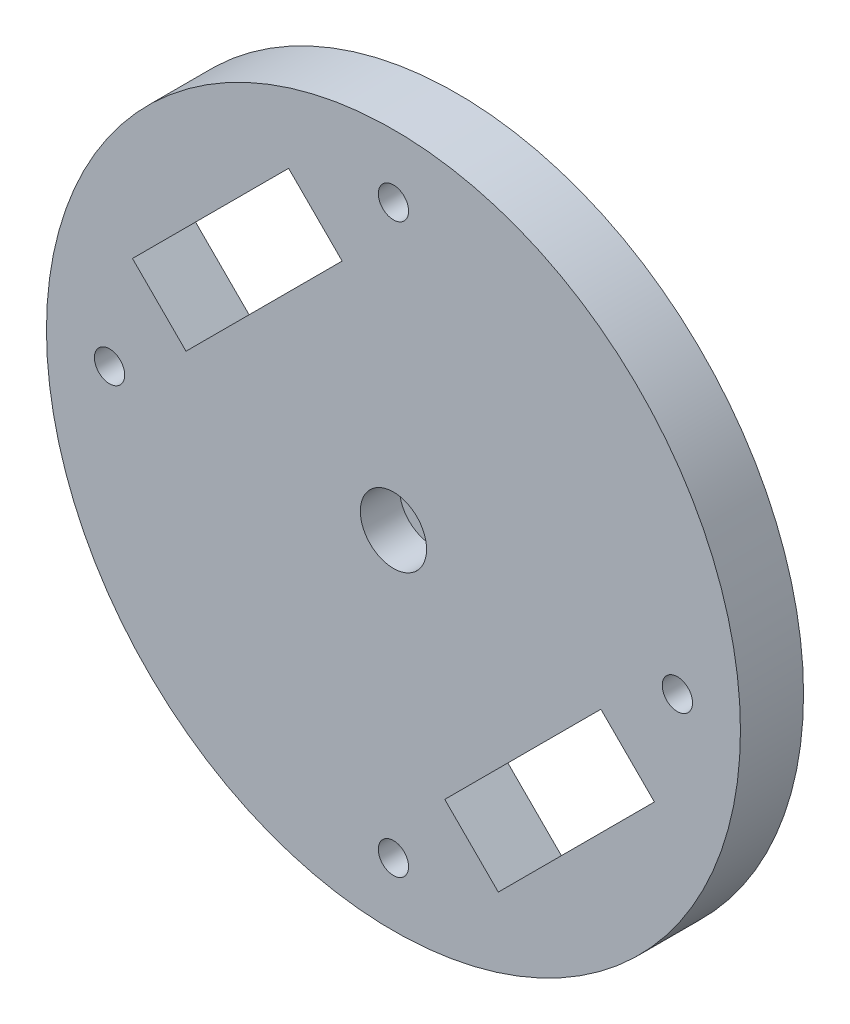
ISO-10303-21;
HEADER;
FILE_DESCRIPTION(('STEP AP214'),'2;1');
FILE_NAME('part.step','',(''),(''),'','','');
FILE_SCHEMA(('AUTOMOTIVE_DESIGN { 1 0 10303 214 1 1 1 1 }'));
ENDSEC;
DATA;
#1=APPLICATION_CONTEXT('core data for automotive mechanical design processes');
#2=APPLICATION_PROTOCOL_DEFINITION('international standard','automotive_design',2000,#1);
#3=PRODUCT_CONTEXT('',#1,'mechanical');
#4=PRODUCT('Part','Part','',(#3));
#5=PRODUCT_RELATED_PRODUCT_CATEGORY('part','',(#4));
#6=PRODUCT_DEFINITION_FORMATION('','',#4);
#7=PRODUCT_DEFINITION_CONTEXT('part definition',#1,'design');
#8=PRODUCT_DEFINITION('design','',#6,#7);
#9=PRODUCT_DEFINITION_SHAPE('','',#8);
#10=(LENGTH_UNIT() NAMED_UNIT(*) SI_UNIT(.MILLI.,.METRE.));
#11=(NAMED_UNIT(*) PLANE_ANGLE_UNIT() SI_UNIT($,.RADIAN.));
#12=(NAMED_UNIT(*) SI_UNIT($,.STERADIAN.) SOLID_ANGLE_UNIT());
#13=UNCERTAINTY_MEASURE_WITH_UNIT(LENGTH_MEASURE(1.E-05),#10,'distance_accuracy_value','');
#14=(GEOMETRIC_REPRESENTATION_CONTEXT(3) GLOBAL_UNCERTAINTY_ASSIGNED_CONTEXT((#13)) GLOBAL_UNIT_ASSIGNED_CONTEXT((#10,
#11,#12)) REPRESENTATION_CONTEXT('',''));
#15=CARTESIAN_POINT('',(0.,0.,0.));
#16=DIRECTION('',(0.,0.,1.));
#17=DIRECTION('',(1.,0.,0.));
#18=AXIS2_PLACEMENT_3D('',#15,#16,#17);
#19=CARTESIAN_POINT('',(0.,0.,44.05));
#20=DIRECTION('',(0.,0.,1.));
#21=DIRECTION('',(1.,0.,0.));
#22=AXIS2_PLACEMENT_3D('',#19,#20,#21);
#23=PLANE('',#22);
#24=CARTESIAN_POINT('',(0.,0.,44.05));
#25=DIRECTION('',(0.,0.,1.));
#26=DIRECTION('',(1.,0.,0.));
#27=AXIS2_PLACEMENT_3D('',#24,#25,#26);
#28=CIRCLE('',#27,3.);
#29=CARTESIAN_POINT('',(3.,0.,44.05));
#30=VERTEX_POINT('',#29);
#31=EDGE_CURVE('E183',#30,#30,#28,.T.);
#32=ORIENTED_EDGE('',*,*,#31,.T.);
#33=EDGE_LOOP('',(#32));
#34=FACE_BOUND('',#33,.T.);
#35=CARTESIAN_POINT('',(0.,0.,44.05));
#36=DIRECTION('',(0.,0.,1.));
#37=DIRECTION('',(1.,0.,0.));
#38=AXIS2_PLACEMENT_3D('',#35,#36,#37);
#39=CIRCLE('',#38,11.25);
#40=CARTESIAN_POINT('',(11.25,0.,44.05));
#41=VERTEX_POINT('',#40);
#42=EDGE_CURVE('E58',#41,#41,#39,.T.);
#43=ORIENTED_EDGE('',*,*,#42,.F.);
#44=EDGE_LOOP('',(#43));
#45=FACE_BOUND('',#44,.T.);
#46=ADVANCED_FACE('F49',(#34,#45),#23,.F.);
#47=CARTESIAN_POINT('',(0.,0.,59.05));
#48=DIRECTION('',(0.,0.,-1.));
#49=DIRECTION('',(-1.,0.,0.));
#50=AXIS2_PLACEMENT_3D('',#47,#48,#49);
#51=CYLINDRICAL_SURFACE('',#50,55.);
#52=CARTESIAN_POINT('',(0.,0.,59.05));
#53=DIRECTION('',(0.,0.,1.));
#54=DIRECTION('',(1.,0.,0.));
#55=AXIS2_PLACEMENT_3D('',#52,#53,#54);
#56=CIRCLE('',#55,55.);
#57=CARTESIAN_POINT('',(55.,0.,59.05));
#58=VERTEX_POINT('',#57);
#59=EDGE_CURVE('E248',#58,#58,#56,.T.);
#60=ORIENTED_EDGE('',*,*,#59,.F.);
#61=EDGE_LOOP('',(#60));
#62=FACE_BOUND('',#61,.T.);
#63=CARTESIAN_POINT('',(0.,0.,49.05));
#64=DIRECTION('',(0.,0.,1.));
#65=DIRECTION('',(1.,0.,0.));
#66=AXIS2_PLACEMENT_3D('',#63,#64,#65);
#67=CIRCLE('',#66,55.);
#68=CARTESIAN_POINT('',(55.,0.,49.05));
#69=VERTEX_POINT('',#68);
#70=EDGE_CURVE('E247',#69,#69,#67,.T.);
#71=ORIENTED_EDGE('',*,*,#70,.T.);
#72=EDGE_LOOP('',(#71));
#73=FACE_BOUND('',#72,.T.);
#74=ADVANCED_FACE('F262',(#62,#73),#51,.T.);
#75=CARTESIAN_POINT('',(0.,0.,59.05));
#76=DIRECTION('',(0.,0.,1.));
#77=DIRECTION('',(1.,0.,0.));
#78=AXIS2_PLACEMENT_3D('',#75,#76,#77);
#79=PLANE('',#78);
#80=CARTESIAN_POINT('',(0.,0.,59.05));
#81=DIRECTION('',(0.,0.,1.));
#82=DIRECTION('',(1.,0.,0.));
#83=AXIS2_PLACEMENT_3D('',#80,#81,#82);
#84=CIRCLE('',#83,5.25);
#85=CARTESIAN_POINT('',(5.25,0.,59.05));
#86=VERTEX_POINT('',#85);
#87=EDGE_CURVE('E339',#86,#86,#84,.T.);
#88=ORIENTED_EDGE('',*,*,#87,.F.);
#89=EDGE_LOOP('',(#88));
#90=FACE_BOUND('',#89,.T.);
#91=DIRECTION('',(-0.707106781186546,0.707106781186549,0.));
#92=VECTOR('',#91,1.);
#93=CARTESIAN_POINT('',(-16.6170093578839,41.3657466994132,59.05));
#94=LINE('',#93,#92);
#95=CARTESIAN_POINT('',(-8.13172798364536,32.8804653251746,59.05));
#96=VERTEX_POINT('',#95);
#97=CARTESIAN_POINT('',(-16.6170093578839,41.3657466994132,59.05));
#98=VERTEX_POINT('',#97);
#99=EDGE_CURVE('E68',#96,#98,#94,.T.);
#100=ORIENTED_EDGE('',*,*,#99,.F.);
#101=DIRECTION('',(0.707106781186549,0.707106781186546,0.));
#102=VECTOR('',#101,1.);
#103=CARTESIAN_POINT('',(-32.8804653251746,8.13172798364545,59.05));
#104=LINE('',#103,#102);
#105=CARTESIAN_POINT('',(-32.8804653251746,8.13172798364545,59.05));
#106=VERTEX_POINT('',#105);
#107=EDGE_CURVE('E136',#106,#96,#104,.T.);
#108=ORIENTED_EDGE('',*,*,#107,.F.);
#109=DIRECTION('',(0.707106781186546,-0.707106781186549,0.));
#110=VECTOR('',#109,1.);
#111=CARTESIAN_POINT('',(-41.3657466994131,16.617009357884,59.05));
#112=LINE('',#111,#110);
#113=CARTESIAN_POINT('',(-41.3657466994131,16.617009357884,59.05));
#114=VERTEX_POINT('',#113);
#115=EDGE_CURVE('E166',#114,#106,#112,.T.);
#116=ORIENTED_EDGE('',*,*,#115,.F.);
#117=DIRECTION('',(-0.707106781186549,-0.707106781186546,0.));
#118=VECTOR('',#117,1.);
#119=CARTESIAN_POINT('',(-16.6170093578839,41.3657466994132,59.05));
#120=LINE('',#119,#118);
#121=EDGE_CURVE('E157',#98,#114,#120,.T.);
#122=ORIENTED_EDGE('',*,*,#121,.F.);
#123=EDGE_LOOP('',(#100,#108,#116,#122));
#124=FACE_BOUND('',#123,.T.);
#125=DIRECTION('',(-0.707106781186547,0.707106781186548,0.));
#126=VECTOR('',#125,1.);
#127=CARTESIAN_POINT('',(41.3657466994131,-16.617009357884,59.05));
#128=LINE('',#127,#126);
#129=CARTESIAN_POINT('',(41.3657466994131,-16.617009357884,59.05));
#130=VERTEX_POINT('',#129);
#131=CARTESIAN_POINT('',(32.8804653251746,-8.13172798364544,59.05));
#132=VERTEX_POINT('',#131);
#133=EDGE_CURVE('E78',#130,#132,#128,.T.);
#134=ORIENTED_EDGE('',*,*,#133,.F.);
#135=DIRECTION('',(0.707106781186548,0.707106781186547,0.));
#136=VECTOR('',#135,1.);
#137=CARTESIAN_POINT('',(41.3657466994131,-16.617009357884,59.05));
#138=LINE('',#137,#136);
#139=CARTESIAN_POINT('',(16.6170093578839,-41.3657466994131,59.05));
#140=VERTEX_POINT('',#139);
#141=EDGE_CURVE('E201',#140,#130,#138,.T.);
#142=ORIENTED_EDGE('',*,*,#141,.F.);
#143=DIRECTION('',(0.707106781186546,-0.707106781186549,0.));
#144=VECTOR('',#143,1.);
#145=CARTESIAN_POINT('',(16.6170093578839,-41.3657466994131,59.05));
#146=LINE('',#145,#144);
#147=CARTESIAN_POINT('',(8.13172798364535,-32.8804653251746,59.05));
#148=VERTEX_POINT('',#147);
#149=EDGE_CURVE('E197',#148,#140,#146,.T.);
#150=ORIENTED_EDGE('',*,*,#149,.F.);
#151=DIRECTION('',(-0.707106781186549,-0.707106781186546,0.));
#152=VECTOR('',#151,1.);
#153=CARTESIAN_POINT('',(8.13172798364535,-32.8804653251746,59.05));
#154=LINE('',#153,#152);
#155=EDGE_CURVE('E193',#132,#148,#154,.T.);
#156=ORIENTED_EDGE('',*,*,#155,.F.);
#157=EDGE_LOOP('',(#134,#142,#150,#156));
#158=FACE_BOUND('',#157,.T.);
#159=CARTESIAN_POINT('',(0.,45.,59.05));
#160=DIRECTION('',(0.,0.,1.));
#161=DIRECTION('',(1.,0.,0.));
#162=AXIS2_PLACEMENT_3D('',#159,#160,#161);
#163=CIRCLE('',#162,2.39999999999999);
#164=CARTESIAN_POINT('',(2.39999999999999,45.,59.05));
#165=VERTEX_POINT('',#164);
#166=EDGE_CURVE('E145',#165,#165,#163,.T.);
#167=ORIENTED_EDGE('',*,*,#166,.F.);
#168=EDGE_LOOP('',(#167));
#169=FACE_BOUND('',#168,.T.);
#170=CARTESIAN_POINT('',(0.,-45.,59.05));
#171=DIRECTION('',(0.,0.,1.));
#172=DIRECTION('',(1.,0.,0.));
#173=AXIS2_PLACEMENT_3D('',#170,#171,#172);
#174=CIRCLE('',#173,2.39999999999999);
#175=CARTESIAN_POINT('',(2.39999999999999,-45.,59.05));
#176=VERTEX_POINT('',#175);
#177=EDGE_CURVE('E227',#176,#176,#174,.T.);
#178=ORIENTED_EDGE('',*,*,#177,.F.);
#179=EDGE_LOOP('',(#178));
#180=FACE_BOUND('',#179,.T.);
#181=CARTESIAN_POINT('',(45.,0.,59.05));
#182=DIRECTION('',(0.,0.,1.));
#183=DIRECTION('',(1.,0.,0.));
#184=AXIS2_PLACEMENT_3D('',#181,#182,#183);
#185=CIRCLE('',#184,2.39999999999999);
#186=CARTESIAN_POINT('',(47.4,0.,59.05));
#187=VERTEX_POINT('',#186);
#188=EDGE_CURVE('E233',#187,#187,#185,.T.);
#189=ORIENTED_EDGE('',*,*,#188,.F.);
#190=EDGE_LOOP('',(#189));
#191=FACE_BOUND('',#190,.T.);
#192=CARTESIAN_POINT('',(-45.,0.,59.05));
#193=DIRECTION('',(0.,0.,1.));
#194=DIRECTION('',(1.,0.,0.));
#195=AXIS2_PLACEMENT_3D('',#192,#193,#194);
#196=CIRCLE('',#195,2.39999999999999);
#197=CARTESIAN_POINT('',(-42.6,0.,59.05));
#198=VERTEX_POINT('',#197);
#199=EDGE_CURVE('E240',#198,#198,#196,.T.);
#200=ORIENTED_EDGE('',*,*,#199,.F.);
#201=EDGE_LOOP('',(#200));
#202=FACE_BOUND('',#201,.T.);
#203=ORIENTED_EDGE('',*,*,#59,.T.);
#204=EDGE_LOOP('',(#203));
#205=FACE_BOUND('',#204,.T.);
#206=ADVANCED_FACE('F267',(#90,#124,#158,#169,#180,#191,#202,#205),#79,.T.);
#207=CARTESIAN_POINT('',(0.,0.,49.05));
#208=DIRECTION('',(0.,0.,1.));
#209=DIRECTION('',(1.,0.,0.));
#210=AXIS2_PLACEMENT_3D('',#207,#208,#209);
#211=PLANE('',#210);
#212=DIRECTION('',(-0.707106781186549,-0.707106781186546,0.));
#213=VECTOR('',#212,1.);
#214=CARTESIAN_POINT('',(-32.8804653251746,8.13172798364545,49.05));
#215=LINE('',#214,#213);
#216=CARTESIAN_POINT('',(-8.13172798364536,32.8804653251746,49.05));
#217=VERTEX_POINT('',#216);
#218=CARTESIAN_POINT('',(-32.8804653251746,8.13172798364545,49.05));
#219=VERTEX_POINT('',#218);
#220=EDGE_CURVE('E151',#217,#219,#215,.T.);
#221=ORIENTED_EDGE('',*,*,#220,.F.);
#222=DIRECTION('',(0.707106781186546,-0.707106781186549,0.));
#223=VECTOR('',#222,1.);
#224=CARTESIAN_POINT('',(-16.6170093578839,41.3657466994132,49.05));
#225=LINE('',#224,#223);
#226=CARTESIAN_POINT('',(-16.6170093578839,41.3657466994132,49.05));
#227=VERTEX_POINT('',#226);
#228=EDGE_CURVE('E129',#227,#217,#225,.T.);
#229=ORIENTED_EDGE('',*,*,#228,.F.);
#230=DIRECTION('',(0.707106781186549,0.707106781186546,0.));
#231=VECTOR('',#230,1.);
#232=CARTESIAN_POINT('',(-16.6170093578839,41.3657466994132,49.05));
#233=LINE('',#232,#231);
#234=CARTESIAN_POINT('',(-41.3657466994131,16.617009357884,49.05));
#235=VERTEX_POINT('',#234);
#236=EDGE_CURVE('E140',#235,#227,#233,.T.);
#237=ORIENTED_EDGE('',*,*,#236,.F.);
#238=DIRECTION('',(-0.707106781186546,0.707106781186549,0.));
#239=VECTOR('',#238,1.);
#240=CARTESIAN_POINT('',(-41.3657466994131,16.617009357884,49.05));
#241=LINE('',#240,#239);
#242=EDGE_CURVE('E160',#219,#235,#241,.T.);
#243=ORIENTED_EDGE('',*,*,#242,.F.);
#244=EDGE_LOOP('',(#221,#229,#237,#243));
#245=FACE_BOUND('',#244,.T.);
#246=DIRECTION('',(-0.707106781186548,-0.707106781186547,0.));
#247=VECTOR('',#246,1.);
#248=CARTESIAN_POINT('',(41.3657466994131,-16.617009357884,49.05));
#249=LINE('',#248,#247);
#250=CARTESIAN_POINT('',(41.3657466994131,-16.617009357884,49.05));
#251=VERTEX_POINT('',#250);
#252=CARTESIAN_POINT('',(16.6170093578839,-41.3657466994131,49.05));
#253=VERTEX_POINT('',#252);
#254=EDGE_CURVE('E182',#251,#253,#249,.T.);
#255=ORIENTED_EDGE('',*,*,#254,.F.);
#256=DIRECTION('',(0.707106781186547,-0.707106781186548,0.));
#257=VECTOR('',#256,1.);
#258=CARTESIAN_POINT('',(41.3657466994131,-16.617009357884,49.05));
#259=LINE('',#258,#257);
#260=CARTESIAN_POINT('',(32.8804653251746,-8.13172798364544,49.05));
#261=VERTEX_POINT('',#260);
#262=EDGE_CURVE('E187',#261,#251,#259,.T.);
#263=ORIENTED_EDGE('',*,*,#262,.F.);
#264=DIRECTION('',(0.707106781186549,0.707106781186546,0.));
#265=VECTOR('',#264,1.);
#266=CARTESIAN_POINT('',(8.13172798364535,-32.8804653251746,49.05));
#267=LINE('',#266,#265);
#268=CARTESIAN_POINT('',(8.13172798364535,-32.8804653251746,49.05));
#269=VERTEX_POINT('',#268);
#270=EDGE_CURVE('E209',#269,#261,#267,.T.);
#271=ORIENTED_EDGE('',*,*,#270,.F.);
#272=DIRECTION('',(-0.707106781186546,0.707106781186549,0.));
#273=VECTOR('',#272,1.);
#274=CARTESIAN_POINT('',(16.6170093578839,-41.3657466994131,49.05));
#275=LINE('',#274,#273);
#276=EDGE_CURVE('E179',#253,#269,#275,.T.);
#277=ORIENTED_EDGE('',*,*,#276,.F.);
#278=EDGE_LOOP('',(#255,#263,#271,#277));
#279=FACE_BOUND('',#278,.T.);
#280=CARTESIAN_POINT('',(0.,45.,49.05));
#281=DIRECTION('',(0.,0.,1.));
#282=DIRECTION('',(1.,0.,0.));
#283=AXIS2_PLACEMENT_3D('',#280,#281,#282);
#284=CIRCLE('',#283,2.4);
#285=CARTESIAN_POINT('',(2.4,45.,49.05));
#286=VERTEX_POINT('',#285);
#287=EDGE_CURVE('E224',#286,#286,#284,.T.);
#288=ORIENTED_EDGE('',*,*,#287,.T.);
#289=EDGE_LOOP('',(#288));
#290=FACE_BOUND('',#289,.T.);
#291=CARTESIAN_POINT('',(0.,-45.,49.05));
#292=DIRECTION('',(0.,0.,1.));
#293=DIRECTION('',(1.,0.,0.));
#294=AXIS2_PLACEMENT_3D('',#291,#292,#293);
#295=CIRCLE('',#294,2.4);
#296=CARTESIAN_POINT('',(2.4,-45.,49.05));
#297=VERTEX_POINT('',#296);
#298=EDGE_CURVE('E230',#297,#297,#295,.T.);
#299=ORIENTED_EDGE('',*,*,#298,.T.);
#300=EDGE_LOOP('',(#299));
#301=FACE_BOUND('',#300,.T.);
#302=CARTESIAN_POINT('',(45.,0.,49.05));
#303=DIRECTION('',(0.,0.,1.));
#304=DIRECTION('',(1.,0.,0.));
#305=AXIS2_PLACEMENT_3D('',#302,#303,#304);
#306=CIRCLE('',#305,2.4);
#307=CARTESIAN_POINT('',(47.4,0.,49.05));
#308=VERTEX_POINT('',#307);
#309=EDGE_CURVE('E237',#308,#308,#306,.T.);
#310=ORIENTED_EDGE('',*,*,#309,.T.);
#311=EDGE_LOOP('',(#310));
#312=FACE_BOUND('',#311,.T.);
#313=CARTESIAN_POINT('',(-45.,0.,49.05));
#314=DIRECTION('',(0.,0.,1.));
#315=DIRECTION('',(1.,0.,0.));
#316=AXIS2_PLACEMENT_3D('',#313,#314,#315);
#317=CIRCLE('',#316,2.4);
#318=CARTESIAN_POINT('',(-42.6,0.,49.05));
#319=VERTEX_POINT('',#318);
#320=EDGE_CURVE('E244',#319,#319,#317,.T.);
#321=ORIENTED_EDGE('',*,*,#320,.T.);
#322=EDGE_LOOP('',(#321));
#323=FACE_BOUND('',#322,.T.);
#324=CARTESIAN_POINT('',(0.,0.,49.05));
#325=DIRECTION('',(0.,0.,1.));
#326=DIRECTION('',(1.,0.,0.));
#327=AXIS2_PLACEMENT_3D('',#324,#325,#326);
#328=CIRCLE('',#327,16.25);
#329=CARTESIAN_POINT('',(16.25,0.,49.05));
#330=VERTEX_POINT('',#329);
#331=EDGE_CURVE('E11',#330,#330,#328,.T.);
#332=ORIENTED_EDGE('',*,*,#331,.T.);
#333=EDGE_LOOP('',(#332));
#334=FACE_BOUND('',#333,.T.);
#335=ORIENTED_EDGE('',*,*,#70,.F.);
#336=EDGE_LOOP('',(#335));
#337=FACE_BOUND('',#336,.T.);
#338=ADVANCED_FACE('F148',(#245,#279,#290,#301,#312,#323,#334,#337),#211,.F.);
#339=CARTESIAN_POINT('',(0.,0.,44.05));
#340=DIRECTION('',(0.,0.,1.));
#341=DIRECTION('',(1.,0.,0.));
#342=AXIS2_PLACEMENT_3D('',#339,#340,#341);
#343=TOROIDAL_SURFACE('',#342,16.25,5.);
#344=ORIENTED_EDGE('',*,*,#42,.T.);
#345=EDGE_LOOP('',(#344));
#346=FACE_BOUND('',#345,.T.);
#347=ORIENTED_EDGE('',*,*,#331,.F.);
#348=EDGE_LOOP('',(#347));
#349=FACE_BOUND('',#348,.T.);
#350=ADVANCED_FACE('F51',(#346,#349),#343,.F.);
#351=CARTESIAN_POINT('',(-45.,0.,59.05));
#352=DIRECTION('',(0.,0.,1.));
#353=DIRECTION('',(1.,0.,0.));
#354=AXIS2_PLACEMENT_3D('',#351,#352,#353);
#355=CYLINDRICAL_SURFACE('',#354,2.4);
#356=ORIENTED_EDGE('',*,*,#320,.F.);
#357=EDGE_LOOP('',(#356));
#358=FACE_BOUND('',#357,.T.);
#359=ORIENTED_EDGE('',*,*,#199,.T.);
#360=EDGE_LOOP('',(#359));
#361=FACE_BOUND('',#360,.T.);
#362=ADVANCED_FACE('F277',(#358,#361),#355,.F.);
#363=CARTESIAN_POINT('',(45.,0.,59.05));
#364=DIRECTION('',(0.,0.,1.));
#365=DIRECTION('',(1.,0.,0.));
#366=AXIS2_PLACEMENT_3D('',#363,#364,#365);
#367=CYLINDRICAL_SURFACE('',#366,2.4);
#368=ORIENTED_EDGE('',*,*,#309,.F.);
#369=EDGE_LOOP('',(#368));
#370=FACE_BOUND('',#369,.T.);
#371=ORIENTED_EDGE('',*,*,#188,.T.);
#372=EDGE_LOOP('',(#371));
#373=FACE_BOUND('',#372,.T.);
#374=ADVANCED_FACE('F280',(#370,#373),#367,.F.);
#375=CARTESIAN_POINT('',(0.,-45.,59.05));
#376=DIRECTION('',(0.,0.,1.));
#377=DIRECTION('',(1.,0.,0.));
#378=AXIS2_PLACEMENT_3D('',#375,#376,#377);
#379=CYLINDRICAL_SURFACE('',#378,2.4);
#380=ORIENTED_EDGE('',*,*,#298,.F.);
#381=EDGE_LOOP('',(#380));
#382=FACE_BOUND('',#381,.T.);
#383=ORIENTED_EDGE('',*,*,#177,.T.);
#384=EDGE_LOOP('',(#383));
#385=FACE_BOUND('',#384,.T.);
#386=ADVANCED_FACE('F284',(#382,#385),#379,.F.);
#387=CARTESIAN_POINT('',(0.,45.,59.05));
#388=DIRECTION('',(0.,0.,1.));
#389=DIRECTION('',(1.,0.,0.));
#390=AXIS2_PLACEMENT_3D('',#387,#388,#389);
#391=CYLINDRICAL_SURFACE('',#390,2.4);
#392=ORIENTED_EDGE('',*,*,#287,.F.);
#393=EDGE_LOOP('',(#392));
#394=FACE_BOUND('',#393,.T.);
#395=ORIENTED_EDGE('',*,*,#166,.T.);
#396=EDGE_LOOP('',(#395));
#397=FACE_BOUND('',#396,.T.);
#398=ADVANCED_FACE('F288',(#394,#397),#391,.F.);
#399=CARTESIAN_POINT('',(41.3657466994131,-16.617009357884,1.999));
#400=DIRECTION('',(0.707106781186548,0.707106781186547,0.));
#401=DIRECTION('',(-0.707106781186547,0.707106781186548,0.));
#402=AXIS2_PLACEMENT_3D('',#399,#400,#401);
#403=PLANE('',#402);
#404=ORIENTED_EDGE('',*,*,#262,.T.);
#405=DIRECTION('',(0.,0.,1.));
#406=VECTOR('',#405,1.);
#407=CARTESIAN_POINT('',(41.3657466994131,-16.617009357884,1.999));
#408=LINE('',#407,#406);
#409=EDGE_CURVE('E206',#251,#130,#408,.T.);
#410=ORIENTED_EDGE('',*,*,#409,.T.);
#411=ORIENTED_EDGE('',*,*,#133,.T.);
#412=DIRECTION('',(0.,0.,1.));
#413=VECTOR('',#412,1.);
#414=CARTESIAN_POINT('',(32.8804653251746,-8.13172798364544,1.999));
#415=LINE('',#414,#413);
#416=EDGE_CURVE('E205',#261,#132,#415,.T.);
#417=ORIENTED_EDGE('',*,*,#416,.F.);
#418=EDGE_LOOP('',(#404,#410,#411,#417));
#419=FACE_BOUND('',#418,.T.);
#420=ADVANCED_FACE('F292',(#419),#403,.F.);
#421=CARTESIAN_POINT('',(41.3657466994131,-16.617009357884,1.999));
#422=DIRECTION('',(0.707106781186547,-0.707106781186548,0.));
#423=DIRECTION('',(0.707106781186548,0.707106781186547,0.));
#424=AXIS2_PLACEMENT_3D('',#421,#422,#423);
#425=PLANE('',#424);
#426=ORIENTED_EDGE('',*,*,#254,.T.);
#427=DIRECTION('',(0.,0.,1.));
#428=VECTOR('',#427,1.);
#429=CARTESIAN_POINT('',(16.6170093578839,-41.3657466994131,1.999));
#430=LINE('',#429,#428);
#431=EDGE_CURVE('E210',#253,#140,#430,.T.);
#432=ORIENTED_EDGE('',*,*,#431,.T.);
#433=ORIENTED_EDGE('',*,*,#141,.T.);
#434=ORIENTED_EDGE('',*,*,#409,.F.);
#435=EDGE_LOOP('',(#426,#432,#433,#434));
#436=FACE_BOUND('',#435,.T.);
#437=ADVANCED_FACE('F296',(#436),#425,.F.);
#438=CARTESIAN_POINT('',(16.6170093578839,-41.3657466994131,1.999));
#439=DIRECTION('',(-0.707106781186549,-0.707106781186546,0.));
#440=DIRECTION('',(0.707106781186546,-0.707106781186549,0.));
#441=AXIS2_PLACEMENT_3D('',#438,#439,#440);
#442=PLANE('',#441);
#443=ORIENTED_EDGE('',*,*,#276,.T.);
#444=DIRECTION('',(0.,0.,1.));
#445=VECTOR('',#444,1.);
#446=CARTESIAN_POINT('',(8.13172798364535,-32.8804653251746,1.999));
#447=LINE('',#446,#445);
#448=EDGE_CURVE('E213',#269,#148,#447,.T.);
#449=ORIENTED_EDGE('',*,*,#448,.T.);
#450=ORIENTED_EDGE('',*,*,#149,.T.);
#451=ORIENTED_EDGE('',*,*,#431,.F.);
#452=EDGE_LOOP('',(#443,#449,#450,#451));
#453=FACE_BOUND('',#452,.T.);
#454=ADVANCED_FACE('F300',(#453),#442,.F.);
#455=CARTESIAN_POINT('',(8.13172798364535,-32.8804653251746,1.999));
#456=DIRECTION('',(-0.707106781186546,0.707106781186549,0.));
#457=DIRECTION('',(-0.707106781186549,-0.707106781186546,0.));
#458=AXIS2_PLACEMENT_3D('',#455,#456,#457);
#459=PLANE('',#458);
#460=ORIENTED_EDGE('',*,*,#270,.T.);
#461=ORIENTED_EDGE('',*,*,#416,.T.);
#462=ORIENTED_EDGE('',*,*,#155,.T.);
#463=ORIENTED_EDGE('',*,*,#448,.F.);
#464=EDGE_LOOP('',(#460,#461,#462,#463));
#465=FACE_BOUND('',#464,.T.);
#466=ADVANCED_FACE('F297',(#465),#459,.F.);
#467=CARTESIAN_POINT('',(-16.6170093578839,41.3657466994132,1.999));
#468=DIRECTION('',(0.707106781186549,0.707106781186546,0.));
#469=DIRECTION('',(-0.707106781186546,0.707106781186549,0.));
#470=AXIS2_PLACEMENT_3D('',#467,#468,#469);
#471=PLANE('',#470);
#472=ORIENTED_EDGE('',*,*,#228,.T.);
#473=DIRECTION('',(0.,0.,1.));
#474=VECTOR('',#473,1.);
#475=CARTESIAN_POINT('',(-8.13172798364536,32.8804653251746,1.999));
#476=LINE('',#475,#474);
#477=EDGE_CURVE('E146',#217,#96,#476,.T.);
#478=ORIENTED_EDGE('',*,*,#477,.T.);
#479=ORIENTED_EDGE('',*,*,#99,.T.);
#480=DIRECTION('',(0.,0.,1.));
#481=VECTOR('',#480,1.);
#482=CARTESIAN_POINT('',(-16.6170093578839,41.3657466994132,1.999));
#483=LINE('',#482,#481);
#484=EDGE_CURVE('E125',#227,#98,#483,.T.);
#485=ORIENTED_EDGE('',*,*,#484,.F.);
#486=EDGE_LOOP('',(#472,#478,#479,#485));
#487=FACE_BOUND('',#486,.T.);
#488=ADVANCED_FACE('F127',(#487),#471,.F.);
#489=CARTESIAN_POINT('',(-32.8804653251746,8.13172798364545,1.999));
#490=DIRECTION('',(0.707106781186546,-0.707106781186549,0.));
#491=DIRECTION('',(0.707106781186549,0.707106781186546,0.));
#492=AXIS2_PLACEMENT_3D('',#489,#490,#491);
#493=PLANE('',#492);
#494=ORIENTED_EDGE('',*,*,#220,.T.);
#495=DIRECTION('',(0.,0.,1.));
#496=VECTOR('',#495,1.);
#497=CARTESIAN_POINT('',(-32.8804653251746,8.13172798364545,1.999));
#498=LINE('',#497,#496);
#499=EDGE_CURVE('E174',#219,#106,#498,.T.);
#500=ORIENTED_EDGE('',*,*,#499,.T.);
#501=ORIENTED_EDGE('',*,*,#107,.T.);
#502=ORIENTED_EDGE('',*,*,#477,.F.);
#503=EDGE_LOOP('',(#494,#500,#501,#502));
#504=FACE_BOUND('',#503,.T.);
#505=ADVANCED_FACE('F310',(#504),#493,.F.);
#506=CARTESIAN_POINT('',(-41.3657466994131,16.617009357884,1.999));
#507=DIRECTION('',(-0.707106781186549,-0.707106781186546,0.));
#508=DIRECTION('',(0.707106781186546,-0.707106781186549,0.));
#509=AXIS2_PLACEMENT_3D('',#506,#507,#508);
#510=PLANE('',#509);
#511=ORIENTED_EDGE('',*,*,#242,.T.);
#512=DIRECTION('',(0.,0.,1.));
#513=VECTOR('',#512,1.);
#514=CARTESIAN_POINT('',(-41.3657466994131,16.617009357884,1.999));
#515=LINE('',#514,#513);
#516=EDGE_CURVE('E135',#235,#114,#515,.T.);
#517=ORIENTED_EDGE('',*,*,#516,.T.);
#518=ORIENTED_EDGE('',*,*,#115,.T.);
#519=ORIENTED_EDGE('',*,*,#499,.F.);
#520=EDGE_LOOP('',(#511,#517,#518,#519));
#521=FACE_BOUND('',#520,.T.);
#522=ADVANCED_FACE('F314',(#521),#510,.F.);
#523=CARTESIAN_POINT('',(-16.6170093578839,41.3657466994132,1.999));
#524=DIRECTION('',(-0.707106781186546,0.707106781186549,0.));
#525=DIRECTION('',(-0.707106781186549,-0.707106781186546,0.));
#526=AXIS2_PLACEMENT_3D('',#523,#524,#525);
#527=PLANE('',#526);
#528=ORIENTED_EDGE('',*,*,#236,.T.);
#529=ORIENTED_EDGE('',*,*,#484,.T.);
#530=ORIENTED_EDGE('',*,*,#121,.T.);
#531=ORIENTED_EDGE('',*,*,#516,.F.);
#532=EDGE_LOOP('',(#528,#529,#530,#531));
#533=FACE_BOUND('',#532,.T.);
#534=ADVANCED_FACE('F141',(#533),#527,.F.);
#535=CARTESIAN_POINT('',(0.,0.,59.05));
#536=DIRECTION('',(0.,0.,1.));
#537=DIRECTION('',(1.,0.,0.));
#538=AXIS2_PLACEMENT_3D('',#535,#536,#537);
#539=CYLINDRICAL_SURFACE('',#538,3.);
#540=ORIENTED_EDGE('',*,*,#31,.F.);
#541=EDGE_LOOP('',(#540));
#542=FACE_BOUND('',#541,.T.);
#543=CARTESIAN_POINT('',(0.,0.,52.85));
#544=DIRECTION('',(0.,0.,1.));
#545=DIRECTION('',(1.,0.,0.));
#546=AXIS2_PLACEMENT_3D('',#543,#544,#545);
#547=CIRCLE('',#546,3.);
#548=CARTESIAN_POINT('',(3.,0.,52.85));
#549=VERTEX_POINT('',#548);
#550=EDGE_CURVE('E343',#549,#549,#547,.T.);
#551=ORIENTED_EDGE('',*,*,#550,.T.);
#552=EDGE_LOOP('',(#551));
#553=FACE_BOUND('',#552,.T.);
#554=ADVANCED_FACE('F313',(#542,#553),#539,.F.);
#555=CARTESIAN_POINT('',(3.,0.,52.85));
#556=DIRECTION('',(0.,0.,-1.));
#557=DIRECTION('',(-1.,0.,0.));
#558=AXIS2_PLACEMENT_3D('',#555,#556,#557);
#559=PLANE('',#558);
#560=ORIENTED_EDGE('',*,*,#550,.F.);
#561=EDGE_LOOP('',(#560));
#562=FACE_BOUND('',#561,.T.);
#563=CARTESIAN_POINT('',(0.,0.,52.85));
#564=DIRECTION('',(0.,0.,1.));
#565=DIRECTION('',(1.,0.,0.));
#566=AXIS2_PLACEMENT_3D('',#563,#564,#565);
#567=CIRCLE('',#566,5.25);
#568=CARTESIAN_POINT('',(5.25,0.,52.85));
#569=VERTEX_POINT('',#568);
#570=EDGE_CURVE('E336',#569,#569,#567,.T.);
#571=ORIENTED_EDGE('',*,*,#570,.T.);
#572=EDGE_LOOP('',(#571));
#573=FACE_BOUND('',#572,.T.);
#574=ADVANCED_FACE('F323',(#562,#573),#559,.F.);
#575=CARTESIAN_POINT('',(0.,0.,59.05));
#576=DIRECTION('',(0.,0.,1.));
#577=DIRECTION('',(1.,0.,0.));
#578=AXIS2_PLACEMENT_3D('',#575,#576,#577);
#579=CYLINDRICAL_SURFACE('',#578,5.25);
#580=ORIENTED_EDGE('',*,*,#570,.F.);
#581=EDGE_LOOP('',(#580));
#582=FACE_BOUND('',#581,.T.);
#583=ORIENTED_EDGE('',*,*,#87,.T.);
#584=EDGE_LOOP('',(#583));
#585=FACE_BOUND('',#584,.T.);
#586=ADVANCED_FACE('F327',(#582,#585),#579,.F.);
#587=CLOSED_SHELL('',(#46,#74,#206,#338,#350,#362,#374,#386,#398,#420,#437,#454,#466,#488,#505,
#522,#534,#554,#574,#586));
#588=MANIFOLD_SOLID_BREP('B2',#587);
#589=ADVANCED_BREP_SHAPE_REPRESENTATION('',(#18,#588),#14);
#590=SHAPE_DEFINITION_REPRESENTATION(#9,#589);
ENDSEC;
END-ISO-10303-21;
